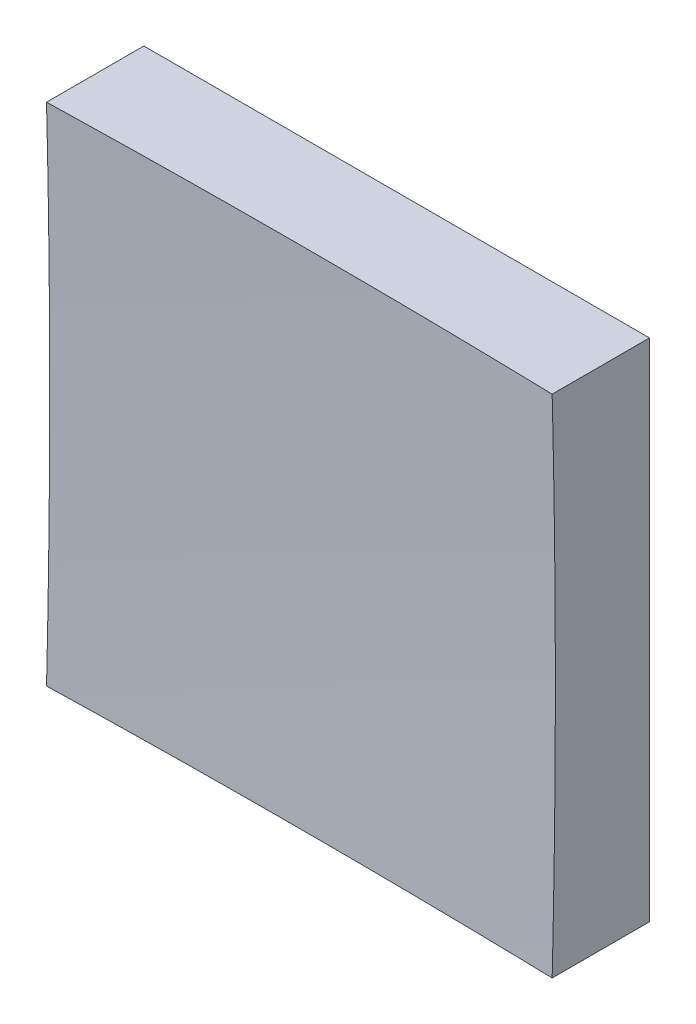
ISO-10303-21;
HEADER;
FILE_DESCRIPTION(('STEP AP214'),'2;1');
FILE_NAME('part.step','',(''),(''),'','','');
FILE_SCHEMA(('AUTOMOTIVE_DESIGN { 1 0 10303 214 1 1 1 1 }'));
ENDSEC;
DATA;
#1=APPLICATION_CONTEXT('core data for automotive mechanical design processes');
#2=APPLICATION_PROTOCOL_DEFINITION('international standard','automotive_design',2000,#1);
#3=PRODUCT_CONTEXT('',#1,'mechanical');
#4=PRODUCT('Part','Part','',(#3));
#5=PRODUCT_RELATED_PRODUCT_CATEGORY('part','',(#4));
#6=PRODUCT_DEFINITION_FORMATION('','',#4);
#7=PRODUCT_DEFINITION_CONTEXT('part definition',#1,'design');
#8=PRODUCT_DEFINITION('design','',#6,#7);
#9=PRODUCT_DEFINITION_SHAPE('','',#8);
#10=(LENGTH_UNIT() NAMED_UNIT(*) SI_UNIT(.MILLI.,.METRE.));
#11=(NAMED_UNIT(*) PLANE_ANGLE_UNIT() SI_UNIT($,.RADIAN.));
#12=(NAMED_UNIT(*) SI_UNIT($,.STERADIAN.) SOLID_ANGLE_UNIT());
#13=UNCERTAINTY_MEASURE_WITH_UNIT(LENGTH_MEASURE(1.E-05),#10,'distance_accuracy_value','');
#14=(GEOMETRIC_REPRESENTATION_CONTEXT(3) GLOBAL_UNCERTAINTY_ASSIGNED_CONTEXT((#13)) GLOBAL_UNIT_ASSIGNED_CONTEXT((#10,
#11,#12)) REPRESENTATION_CONTEXT('',''));
#15=CARTESIAN_POINT('',(0.,0.,0.));
#16=DIRECTION('',(0.,0.,1.));
#17=DIRECTION('',(1.,0.,0.));
#18=AXIS2_PLACEMENT_3D('',#15,#16,#17);
#19=CARTESIAN_POINT('',(-25.,25.,50.));
#20=DIRECTION('',(0.,1.,0.));
#21=DIRECTION('',(0.,0.,1.));
#22=AXIS2_PLACEMENT_3D('',#19,#20,#21);
#23=PLANE('',#22);
#24=CARTESIAN_POINT('',(1.23566862033968E-13,25.,1009.));
#25=DIRECTION('',(0.,1.,0.));
#26=DIRECTION('',(0.,0.,1.));
#27=AXIS2_PLACEMENT_3D('',#24,#25,#26);
#28=CIRCLE('',#27,999.68745115661);
#29=CARTESIAN_POINT('',(25.,25.,9.62519543466567));
#30=VERTEX_POINT('',#29);
#31=CARTESIAN_POINT('',(-25.,25.,9.62519543466567));
#32=VERTEX_POINT('',#31);
#33=EDGE_CURVE('E79',#30,#32,#28,.T.);
#34=ORIENTED_EDGE('',*,*,#33,.F.);
#35=DIRECTION('',(0.,0.,-1.));
#36=VECTOR('',#35,1.);
#37=CARTESIAN_POINT('',(25.,25.,50.));
#38=LINE('',#37,#36);
#39=CARTESIAN_POINT('',(25.,25.,0.));
#40=VERTEX_POINT('',#39);
#41=EDGE_CURVE('E85',#30,#40,#38,.T.);
#42=ORIENTED_EDGE('',*,*,#41,.T.);
#43=DIRECTION('',(1.,0.,0.));
#44=VECTOR('',#43,1.);
#45=CARTESIAN_POINT('',(-25.,25.,0.));
#46=LINE('',#45,#44);
#47=CARTESIAN_POINT('',(-25.,25.,0.));
#48=VERTEX_POINT('',#47);
#49=EDGE_CURVE('E88',#48,#40,#46,.T.);
#50=ORIENTED_EDGE('',*,*,#49,.F.);
#51=DIRECTION('',(0.,0.,-1.));
#52=VECTOR('',#51,1.);
#53=CARTESIAN_POINT('',(-25.,25.,50.));
#54=LINE('',#53,#52);
#55=EDGE_CURVE('E47',#32,#48,#54,.T.);
#56=ORIENTED_EDGE('',*,*,#55,.F.);
#57=EDGE_LOOP('',(#34,#42,#50,#56));
#58=FACE_BOUND('',#57,.T.);
#59=ADVANCED_FACE('F39',(#58),#23,.T.);
#60=CARTESIAN_POINT('',(-25.,25.,50.));
#61=DIRECTION('',(1.,0.,0.));
#62=DIRECTION('',(0.,1.,0.));
#63=AXIS2_PLACEMENT_3D('',#60,#61,#62);
#64=PLANE('',#63);
#65=DIRECTION('',(0.,0.,-1.));
#66=VECTOR('',#65,1.);
#67=CARTESIAN_POINT('',(-25.,-25.,50.));
#68=LINE('',#67,#66);
#69=CARTESIAN_POINT('',(-25.,-25.,9.62519543466567));
#70=VERTEX_POINT('',#69);
#71=CARTESIAN_POINT('',(-25.,-25.,0.));
#72=VERTEX_POINT('',#71);
#73=EDGE_CURVE('E100',#70,#72,#68,.T.);
#74=ORIENTED_EDGE('',*,*,#73,.F.);
#75=CARTESIAN_POINT('',(-25.,0.,1009.));
#76=DIRECTION('',(1.,0.,0.));
#77=DIRECTION('',(0.,1.,0.));
#78=AXIS2_PLACEMENT_3D('',#75,#76,#77);
#79=CIRCLE('',#78,999.68745115661);
#80=EDGE_CURVE('E89',#70,#32,#79,.T.);
#81=ORIENTED_EDGE('',*,*,#80,.T.);
#82=ORIENTED_EDGE('',*,*,#55,.T.);
#83=DIRECTION('',(0.,-1.,0.));
#84=VECTOR('',#83,1.);
#85=CARTESIAN_POINT('',(-25.,25.,0.));
#86=LINE('',#85,#84);
#87=EDGE_CURVE('E97',#48,#72,#86,.T.);
#88=ORIENTED_EDGE('',*,*,#87,.T.);
#89=EDGE_LOOP('',(#74,#81,#82,#88));
#90=FACE_BOUND('',#89,.T.);
#91=ADVANCED_FACE('F122',(#90),#64,.F.);
#92=CARTESIAN_POINT('',(-25.,-25.,50.));
#93=DIRECTION('',(0.,1.,0.));
#94=DIRECTION('',(0.,0.,1.));
#95=AXIS2_PLACEMENT_3D('',#92,#93,#94);
#96=PLANE('',#95);
#97=DIRECTION('',(0.,0.,-1.));
#98=VECTOR('',#97,1.);
#99=CARTESIAN_POINT('',(25.,-25.,50.));
#100=LINE('',#99,#98);
#101=CARTESIAN_POINT('',(25.,-25.,9.62519543466567));
#102=VERTEX_POINT('',#101);
#103=CARTESIAN_POINT('',(25.,-25.,0.));
#104=VERTEX_POINT('',#103);
#105=EDGE_CURVE('E96',#102,#104,#100,.T.);
#106=ORIENTED_EDGE('',*,*,#105,.F.);
#107=CARTESIAN_POINT('',(1.23566862033968E-13,-25.,1009.));
#108=DIRECTION('',(0.,1.,0.));
#109=DIRECTION('',(0.,0.,1.));
#110=AXIS2_PLACEMENT_3D('',#107,#108,#109);
#111=CIRCLE('',#110,999.68745115661);
#112=EDGE_CURVE('E53',#102,#70,#111,.T.);
#113=ORIENTED_EDGE('',*,*,#112,.T.);
#114=ORIENTED_EDGE('',*,*,#73,.T.);
#115=DIRECTION('',(1.,0.,0.));
#116=VECTOR('',#115,1.);
#117=CARTESIAN_POINT('',(-25.,-25.,0.));
#118=LINE('',#117,#116);
#119=EDGE_CURVE('E102',#72,#104,#118,.T.);
#120=ORIENTED_EDGE('',*,*,#119,.T.);
#121=EDGE_LOOP('',(#106,#113,#114,#120));
#122=FACE_BOUND('',#121,.T.);
#123=ADVANCED_FACE('F121',(#122),#96,.F.);
#124=CARTESIAN_POINT('',(25.,25.,50.));
#125=DIRECTION('',(1.,0.,0.));
#126=DIRECTION('',(0.,1.,0.));
#127=AXIS2_PLACEMENT_3D('',#124,#125,#126);
#128=PLANE('',#127);
#129=CARTESIAN_POINT('',(25.,0.,1009.));
#130=DIRECTION('',(1.,0.,0.));
#131=DIRECTION('',(0.,1.,0.));
#132=AXIS2_PLACEMENT_3D('',#129,#130,#131);
#133=CIRCLE('',#132,999.68745115661);
#134=EDGE_CURVE('E11',#102,#30,#133,.T.);
#135=ORIENTED_EDGE('',*,*,#134,.F.);
#136=ORIENTED_EDGE('',*,*,#105,.T.);
#137=DIRECTION('',(0.,-1.,0.));
#138=VECTOR('',#137,1.);
#139=CARTESIAN_POINT('',(25.,25.,0.));
#140=LINE('',#139,#138);
#141=EDGE_CURVE('E93',#40,#104,#140,.T.);
#142=ORIENTED_EDGE('',*,*,#141,.F.);
#143=ORIENTED_EDGE('',*,*,#41,.F.);
#144=EDGE_LOOP('',(#135,#136,#142,#143));
#145=FACE_BOUND('',#144,.T.);
#146=ADVANCED_FACE('F91',(#145),#128,.T.);
#147=CARTESIAN_POINT('',(0.,0.,0.));
#148=DIRECTION('',(0.,0.,-1.));
#149=DIRECTION('',(-1.,0.,0.));
#150=AXIS2_PLACEMENT_3D('',#147,#148,#149);
#151=PLANE('',#150);
#152=ORIENTED_EDGE('',*,*,#49,.T.);
#153=ORIENTED_EDGE('',*,*,#141,.T.);
#154=ORIENTED_EDGE('',*,*,#119,.F.);
#155=ORIENTED_EDGE('',*,*,#87,.F.);
#156=EDGE_LOOP('',(#152,#153,#154,#155));
#157=FACE_BOUND('',#156,.T.);
#158=ADVANCED_FACE('F125',(#157),#151,.T.);
#159=CARTESIAN_POINT('',(1.23566862033968E-13,0.,1009.));
#160=DIRECTION('',(0.,0.,1.));
#161=DIRECTION('',(1.,0.,0.));
#162=AXIS2_PLACEMENT_3D('',#159,#160,#161);
#163=SPHERICAL_SURFACE('',#162,1000.);
#164=ORIENTED_EDGE('',*,*,#33,.T.);
#165=ORIENTED_EDGE('',*,*,#80,.F.);
#166=ORIENTED_EDGE('',*,*,#112,.F.);
#167=ORIENTED_EDGE('',*,*,#134,.T.);
#168=EDGE_LOOP('',(#164,#165,#166,#167));
#169=FACE_BOUND('',#168,.T.);
#170=ADVANCED_FACE('F78',(#169),#163,.F.);
#171=CLOSED_SHELL('',(#59,#91,#123,#146,#158,#170));
#172=MANIFOLD_SOLID_BREP('B2',#171);
#173=ADVANCED_BREP_SHAPE_REPRESENTATION('',(#18,#172),#14);
#174=SHAPE_DEFINITION_REPRESENTATION(#9,#173);
ENDSEC;
END-ISO-10303-21;
